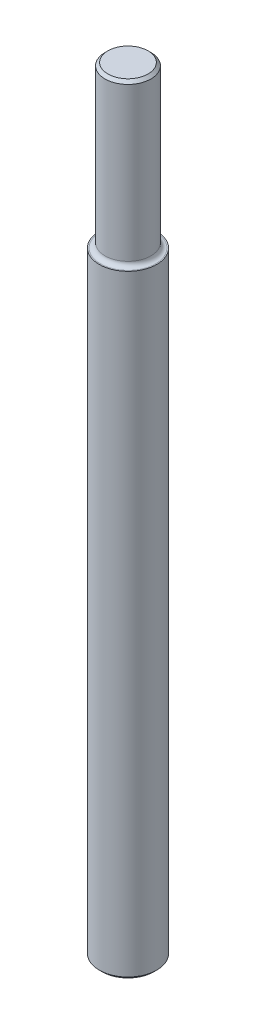
ISO-10303-21;
HEADER;
FILE_DESCRIPTION(('STEP AP214'),'2;1');
FILE_NAME('part.step','',(''),(''),'','','');
FILE_SCHEMA(('AUTOMOTIVE_DESIGN { 1 0 10303 214 1 1 1 1 }'));
ENDSEC;
DATA;
#1=APPLICATION_CONTEXT('core data for automotive mechanical design processes');
#2=APPLICATION_PROTOCOL_DEFINITION('international standard','automotive_design',2000,#1);
#3=PRODUCT_CONTEXT('',#1,'mechanical');
#4=PRODUCT('Part','Part','',(#3));
#5=PRODUCT_RELATED_PRODUCT_CATEGORY('part','',(#4));
#6=PRODUCT_DEFINITION_FORMATION('','',#4);
#7=PRODUCT_DEFINITION_CONTEXT('part definition',#1,'design');
#8=PRODUCT_DEFINITION('design','',#6,#7);
#9=PRODUCT_DEFINITION_SHAPE('','',#8);
#10=(LENGTH_UNIT() NAMED_UNIT(*) SI_UNIT(.MILLI.,.METRE.));
#11=(NAMED_UNIT(*) PLANE_ANGLE_UNIT() SI_UNIT($,.RADIAN.));
#12=(NAMED_UNIT(*) SI_UNIT($,.STERADIAN.) SOLID_ANGLE_UNIT());
#13=UNCERTAINTY_MEASURE_WITH_UNIT(LENGTH_MEASURE(1.E-05),#10,'distance_accuracy_value','');
#14=(GEOMETRIC_REPRESENTATION_CONTEXT(3) GLOBAL_UNCERTAINTY_ASSIGNED_CONTEXT((#13)) GLOBAL_UNIT_ASSIGNED_CONTEXT((#10,
#11,#12)) REPRESENTATION_CONTEXT('',''));
#15=CARTESIAN_POINT('',(0.,0.,0.));
#16=DIRECTION('',(0.,0.,1.));
#17=DIRECTION('',(1.,0.,0.));
#18=AXIS2_PLACEMENT_3D('',#15,#16,#17);
#19=CARTESIAN_POINT('',(0.,270.,0.));
#20=DIRECTION('',(0.,-1.,0.));
#21=DIRECTION('',(0.,0.,-1.));
#22=AXIS2_PLACEMENT_3D('',#19,#20,#21);
#23=CYLINDRICAL_SURFACE('',#22,10.);
#24=CARTESIAN_POINT('',(0.,1.,0.));
#25=DIRECTION('',(0.,1.,0.));
#26=DIRECTION('',(0.,0.,1.));
#27=AXIS2_PLACEMENT_3D('',#24,#25,#26);
#28=CIRCLE('',#27,10.);
#29=CARTESIAN_POINT('',(0.,1.,10.));
#30=VERTEX_POINT('',#29);
#31=EDGE_CURVE('E48',#30,#30,#28,.T.);
#32=ORIENTED_EDGE('',*,*,#31,.T.);
#33=EDGE_LOOP('',(#32));
#34=FACE_BOUND('',#33,.T.);
#35=CARTESIAN_POINT('',(0.,214.,0.));
#36=DIRECTION('',(0.,1.,0.));
#37=DIRECTION('',(0.,0.,1.));
#38=AXIS2_PLACEMENT_3D('',#35,#36,#37);
#39=CIRCLE('',#38,10.);
#40=CARTESIAN_POINT('',(0.,214.,10.));
#41=VERTEX_POINT('',#40);
#42=EDGE_CURVE('E59',#41,#41,#39,.T.);
#43=ORIENTED_EDGE('',*,*,#42,.F.);
#44=EDGE_LOOP('',(#43));
#45=FACE_BOUND('',#44,.T.);
#46=ADVANCED_FACE('F33',(#34,#45),#23,.T.);
#47=CARTESIAN_POINT('',(0.,0.,0.));
#48=DIRECTION('',(0.,1.,0.));
#49=DIRECTION('',(0.,0.,1.));
#50=AXIS2_PLACEMENT_3D('',#47,#48,#49);
#51=PLANE('',#50);
#52=CARTESIAN_POINT('',(0.,0.,0.));
#53=DIRECTION('',(0.,1.,0.));
#54=DIRECTION('',(0.,0.,1.));
#55=AXIS2_PLACEMENT_3D('',#52,#53,#54);
#56=CIRCLE('',#55,9.00000000000004);
#57=CARTESIAN_POINT('',(0.,0.,9.00000000000004));
#58=VERTEX_POINT('',#57);
#59=EDGE_CURVE('E44',#58,#58,#56,.F.);
#60=ORIENTED_EDGE('',*,*,#59,.T.);
#61=EDGE_LOOP('',(#60));
#62=FACE_BOUND('',#61,.T.);
#63=ADVANCED_FACE('F66',(#62),#51,.F.);
#64=CARTESIAN_POINT('',(0.,214.,0.));
#65=DIRECTION('',(0.,1.,0.));
#66=DIRECTION('',(0.,0.,1.));
#67=AXIS2_PLACEMENT_3D('',#64,#65,#66);
#68=PLANE('',#67);
#69=CARTESIAN_POINT('',(0.,214.,0.));
#70=DIRECTION('',(0.,1.,0.));
#71=DIRECTION('',(0.,0.,1.));
#72=AXIS2_PLACEMENT_3D('',#69,#70,#71);
#73=CIRCLE('',#72,9.6);
#74=CARTESIAN_POINT('',(0.,214.,9.6));
#75=VERTEX_POINT('',#74);
#76=EDGE_CURVE('E53',#75,#75,#73,.F.);
#77=ORIENTED_EDGE('',*,*,#76,.T.);
#78=EDGE_LOOP('',(#77));
#79=FACE_BOUND('',#78,.T.);
#80=ORIENTED_EDGE('',*,*,#42,.T.);
#81=EDGE_LOOP('',(#80));
#82=FACE_BOUND('',#81,.T.);
#83=ADVANCED_FACE('F63',(#79,#82),#68,.T.);
#84=CARTESIAN_POINT('',(0.,214.,0.));
#85=DIRECTION('',(0.,1.,0.));
#86=DIRECTION('',(0.,0.,1.));
#87=AXIS2_PLACEMENT_3D('',#84,#85,#86);
#88=CYLINDRICAL_SURFACE('',#87,8.);
#89=CARTESIAN_POINT('',(0.,269.,0.));
#90=DIRECTION('',(0.,1.,0.));
#91=DIRECTION('',(0.,0.,1.));
#92=AXIS2_PLACEMENT_3D('',#89,#90,#91);
#93=CIRCLE('',#92,8.);
#94=CARTESIAN_POINT('',(0.,269.,8.));
#95=VERTEX_POINT('',#94);
#96=EDGE_CURVE('E11',#95,#95,#93,.F.);
#97=ORIENTED_EDGE('',*,*,#96,.T.);
#98=EDGE_LOOP('',(#97));
#99=FACE_BOUND('',#98,.T.);
#100=CARTESIAN_POINT('',(0.,215.6,0.));
#101=DIRECTION('',(0.,1.,0.));
#102=DIRECTION('',(0.,0.,1.));
#103=AXIS2_PLACEMENT_3D('',#100,#101,#102);
#104=CIRCLE('',#103,8.);
#105=CARTESIAN_POINT('',(0.,215.6,8.));
#106=VERTEX_POINT('',#105);
#107=EDGE_CURVE('E56',#106,#106,#104,.T.);
#108=ORIENTED_EDGE('',*,*,#107,.T.);
#109=EDGE_LOOP('',(#108));
#110=FACE_BOUND('',#109,.T.);
#111=ADVANCED_FACE('F107',(#99,#110),#88,.T.);
#112=CARTESIAN_POINT('',(0.,270.,0.));
#113=DIRECTION('',(0.,1.,0.));
#114=DIRECTION('',(0.,0.,1.));
#115=AXIS2_PLACEMENT_3D('',#112,#113,#114);
#116=PLANE('',#115);
#117=CARTESIAN_POINT('',(0.,270.,0.));
#118=DIRECTION('',(0.,1.,0.));
#119=DIRECTION('',(0.,0.,1.));
#120=AXIS2_PLACEMENT_3D('',#117,#118,#119);
#121=CIRCLE('',#120,7.00000000000003);
#122=CARTESIAN_POINT('',(0.,270.,7.00000000000003));
#123=VERTEX_POINT('',#122);
#124=EDGE_CURVE('E40',#123,#123,#121,.T.);
#125=ORIENTED_EDGE('',*,*,#124,.T.);
#126=EDGE_LOOP('',(#125));
#127=FACE_BOUND('',#126,.T.);
#128=ADVANCED_FACE('F79',(#127),#116,.T.);
#129=CARTESIAN_POINT('',(0.,215.6,0.));
#130=DIRECTION('',(0.,1.,0.));
#131=DIRECTION('',(0.,0.,1.));
#132=AXIS2_PLACEMENT_3D('',#129,#130,#131);
#133=TOROIDAL_SURFACE('',#132,9.6,1.6);
#134=ORIENTED_EDGE('',*,*,#76,.F.);
#135=EDGE_LOOP('',(#134));
#136=FACE_BOUND('',#135,.T.);
#137=ORIENTED_EDGE('',*,*,#107,.F.);
#138=EDGE_LOOP('',(#137));
#139=FACE_BOUND('',#138,.T.);
#140=ADVANCED_FACE('F76',(#136,#139),#133,.F.);
#141=CARTESIAN_POINT('',(0.,1.,0.));
#142=DIRECTION('',(0.,1.,0.));
#143=DIRECTION('',(0.,0.,1.));
#144=AXIS2_PLACEMENT_3D('',#141,#142,#143);
#145=CONICAL_SURFACE('',#144,10.,0.78539816339743);
#146=ORIENTED_EDGE('',*,*,#59,.F.);
#147=EDGE_LOOP('',(#146));
#148=FACE_BOUND('',#147,.T.);
#149=ORIENTED_EDGE('',*,*,#31,.F.);
#150=EDGE_LOOP('',(#149));
#151=FACE_BOUND('',#150,.T.);
#152=ADVANCED_FACE('F78',(#148,#151),#145,.T.);
#153=CARTESIAN_POINT('',(0.,270.,0.));
#154=DIRECTION('',(0.,-1.,0.));
#155=DIRECTION('',(0.,0.,-1.));
#156=AXIS2_PLACEMENT_3D('',#153,#154,#155);
#157=CONICAL_SURFACE('',#156,7.00000000000003,0.785398163397459);
#158=ORIENTED_EDGE('',*,*,#96,.F.);
#159=EDGE_LOOP('',(#158));
#160=FACE_BOUND('',#159,.T.);
#161=ORIENTED_EDGE('',*,*,#124,.F.);
#162=EDGE_LOOP('',(#161));
#163=FACE_BOUND('',#162,.T.);
#164=ADVANCED_FACE('F35',(#160,#163),#157,.T.);
#165=CLOSED_SHELL('',(#46,#63,#83,#111,#128,#140,#152,#164));
#166=MANIFOLD_SOLID_BREP('B2',#165);
#167=ADVANCED_BREP_SHAPE_REPRESENTATION('',(#18,#166),#14);
#168=SHAPE_DEFINITION_REPRESENTATION(#9,#167);
ENDSEC;
END-ISO-10303-21;
